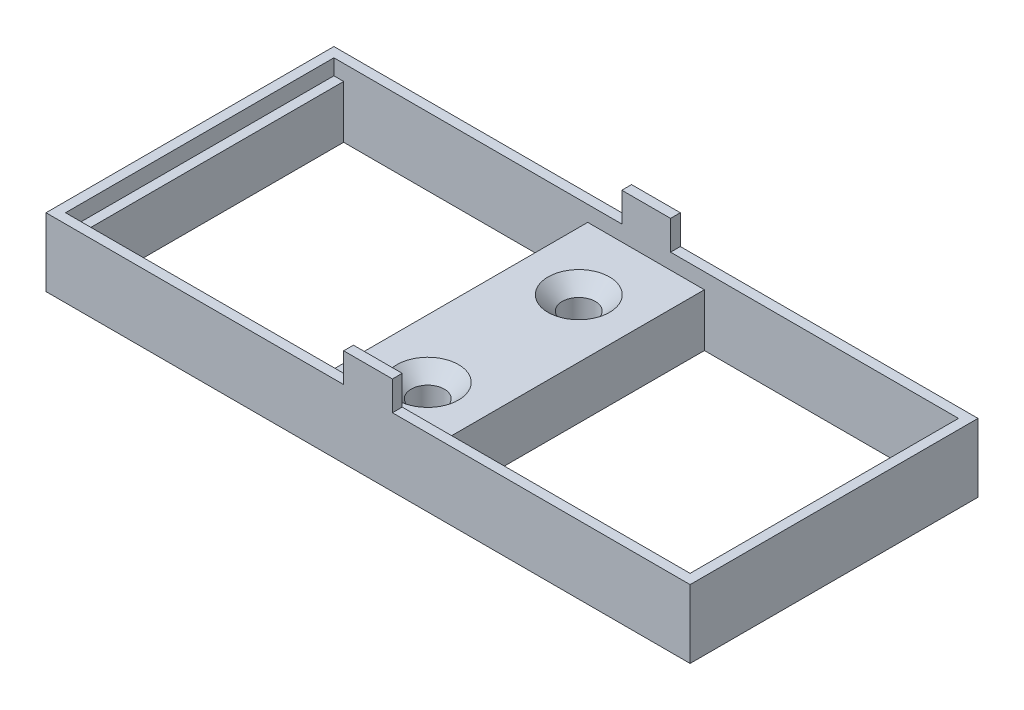
ISO-10303-21;
HEADER;
FILE_DESCRIPTION(('STEP AP214'),'2;1');
FILE_NAME('part.step','',(''),(''),'','','');
FILE_SCHEMA(('AUTOMOTIVE_DESIGN { 1 0 10303 214 1 1 1 1 }'));
ENDSEC;
DATA;
#1=APPLICATION_CONTEXT('core data for automotive mechanical design processes');
#2=APPLICATION_PROTOCOL_DEFINITION('international standard','automotive_design',2000,#1);
#3=PRODUCT_CONTEXT('',#1,'mechanical');
#4=PRODUCT('Part','Part','',(#3));
#5=PRODUCT_RELATED_PRODUCT_CATEGORY('part','',(#4));
#6=PRODUCT_DEFINITION_FORMATION('','',#4);
#7=PRODUCT_DEFINITION_CONTEXT('part definition',#1,'design');
#8=PRODUCT_DEFINITION('design','',#6,#7);
#9=PRODUCT_DEFINITION_SHAPE('','',#8);
#10=(LENGTH_UNIT() NAMED_UNIT(*) SI_UNIT(.MILLI.,.METRE.));
#11=(NAMED_UNIT(*) PLANE_ANGLE_UNIT() SI_UNIT($,.RADIAN.));
#12=(NAMED_UNIT(*) SI_UNIT($,.STERADIAN.) SOLID_ANGLE_UNIT());
#13=UNCERTAINTY_MEASURE_WITH_UNIT(LENGTH_MEASURE(1.E-05),#10,'distance_accuracy_value','');
#14=(GEOMETRIC_REPRESENTATION_CONTEXT(3) GLOBAL_UNCERTAINTY_ASSIGNED_CONTEXT((#13)) GLOBAL_UNIT_ASSIGNED_CONTEXT((#10,
#11,#12)) REPRESENTATION_CONTEXT('',''));
#15=CARTESIAN_POINT('',(0.,0.,0.));
#16=DIRECTION('',(0.,0.,1.));
#17=DIRECTION('',(1.,0.,0.));
#18=AXIS2_PLACEMENT_3D('',#15,#16,#17);
#19=CARTESIAN_POINT('',(0.,5.4,0.));
#20=DIRECTION('',(0.,1.,0.));
#21=DIRECTION('',(0.,0.,1.));
#22=AXIS2_PLACEMENT_3D('',#19,#20,#21);
#23=PLANE('',#22);
#24=DIRECTION('',(0.,0.,1.));
#25=VECTOR('',#24,1.);
#26=CARTESIAN_POINT('',(2.,5.4,1.));
#27=LINE('',#26,#25);
#28=CARTESIAN_POINT('',(2.,5.4,1.));
#29=VERTEX_POINT('',#28);
#30=CARTESIAN_POINT('',(2.,5.4,28.5));
#31=VERTEX_POINT('',#30);
#32=EDGE_CURVE('E211',#29,#31,#27,.T.);
#33=ORIENTED_EDGE('',*,*,#32,.F.);
#34=DIRECTION('',(-1.,0.,0.));
#35=VECTOR('',#34,1.);
#36=CARTESIAN_POINT('',(1.,5.4,1.));
#37=LINE('',#36,#35);
#38=CARTESIAN_POINT('',(1.,5.4,1.));
#39=VERTEX_POINT('',#38);
#40=EDGE_CURVE('E226',#29,#39,#37,.T.);
#41=ORIENTED_EDGE('',*,*,#40,.T.);
#42=DIRECTION('',(0.,0.,1.));
#43=VECTOR('',#42,1.);
#44=CARTESIAN_POINT('',(1.,5.4,1.));
#45=LINE('',#44,#43);
#46=CARTESIAN_POINT('',(1.,5.4,28.5));
#47=VERTEX_POINT('',#46);
#48=EDGE_CURVE('E220',#39,#47,#45,.T.);
#49=ORIENTED_EDGE('',*,*,#48,.T.);
#50=DIRECTION('',(1.,0.,0.));
#51=VECTOR('',#50,1.);
#52=CARTESIAN_POINT('',(1.,5.4,28.5));
#53=LINE('',#52,#51);
#54=EDGE_CURVE('E202',#47,#31,#53,.T.);
#55=ORIENTED_EDGE('',*,*,#54,.T.);
#56=EDGE_LOOP('',(#33,#41,#49,#55));
#57=FACE_BOUND('',#56,.T.);
#58=ADVANCED_FACE('F35',(#57),#23,.T.);
#59=CARTESIAN_POINT('',(32.9664490428989,5.4,7.875));
#60=DIRECTION('',(0.,1.,0.));
#61=DIRECTION('',(0.,0.,1.));
#62=AXIS2_PLACEMENT_3D('',#59,#60,#61);
#63=CIRCLE('',#62,3.15);
#64=CARTESIAN_POINT('',(32.9664490428989,5.4,11.025));
#65=VERTEX_POINT('',#64);
#66=EDGE_CURVE('E269',#65,#65,#63,.T.);
#67=ORIENTED_EDGE('',*,*,#66,.F.);
#68=EDGE_LOOP('',(#67));
#69=FACE_BOUND('',#68,.T.);
#70=CARTESIAN_POINT('',(33.0089004378733,5.4,23.3906336009247));
#71=DIRECTION('',(0.,1.,0.));
#72=DIRECTION('',(0.,0.,1.));
#73=AXIS2_PLACEMENT_3D('',#70,#71,#72);
#74=CIRCLE('',#73,3.15);
#75=CARTESIAN_POINT('',(33.0089004378733,5.4,26.5406336009247));
#76=VERTEX_POINT('',#75);
#77=EDGE_CURVE('E260',#76,#76,#74,.T.);
#78=ORIENTED_EDGE('',*,*,#77,.F.);
#79=EDGE_LOOP('',(#78));
#80=FACE_BOUND('',#79,.T.);
#81=DIRECTION('',(0.,0.,-1.));
#82=VECTOR('',#81,1.);
#83=CARTESIAN_POINT('',(27.0089004378733,5.4,1.));
#84=LINE('',#83,#82);
#85=CARTESIAN_POINT('',(27.0089004378733,5.4,28.5));
#86=VERTEX_POINT('',#85);
#87=CARTESIAN_POINT('',(27.0089004378733,5.4,1.));
#88=VERTEX_POINT('',#87);
#89=EDGE_CURVE('E208',#86,#88,#84,.T.);
#90=ORIENTED_EDGE('',*,*,#89,.F.);
#91=CARTESIAN_POINT('',(38.9664490428989,5.4,28.5));
#92=VERTEX_POINT('',#91);
#93=EDGE_CURVE('E222',#86,#92,#53,.T.);
#94=ORIENTED_EDGE('',*,*,#93,.T.);
#95=DIRECTION('',(0.,0.,1.));
#96=VECTOR('',#95,1.);
#97=CARTESIAN_POINT('',(38.9664490428989,5.4,1.));
#98=LINE('',#97,#96);
#99=CARTESIAN_POINT('',(38.9664490428989,5.4,1.));
#100=VERTEX_POINT('',#99);
#101=EDGE_CURVE('E245',#100,#92,#98,.T.);
#102=ORIENTED_EDGE('',*,*,#101,.F.);
#103=EDGE_CURVE('E287',#100,#88,#37,.T.);
#104=ORIENTED_EDGE('',*,*,#103,.T.);
#105=EDGE_LOOP('',(#90,#94,#102,#104));
#106=FACE_BOUND('',#105,.T.);
#107=ADVANCED_FACE('F275',(#69,#80,#106),#23,.T.);
#108=CARTESIAN_POINT('',(0.,7.,0.));
#109=DIRECTION('',(0.,-1.,0.));
#110=DIRECTION('',(0.,0.,-1.));
#111=AXIS2_PLACEMENT_3D('',#108,#109,#110);
#112=PLANE('',#111);
#113=DIRECTION('',(0.,0.,-1.));
#114=VECTOR('',#113,1.);
#115=CARTESIAN_POINT('',(35.5,7.,0.));
#116=LINE('',#115,#114);
#117=CARTESIAN_POINT('',(35.5,7.,1.));
#118=VERTEX_POINT('',#117);
#119=CARTESIAN_POINT('',(35.5,7.,0.));
#120=VERTEX_POINT('',#119);
#121=EDGE_CURVE('E353',#118,#120,#116,.T.);
#122=ORIENTED_EDGE('',*,*,#121,.F.);
#123=DIRECTION('',(-1.,0.,0.));
#124=VECTOR('',#123,1.);
#125=CARTESIAN_POINT('',(1.,7.,1.));
#126=LINE('',#125,#124);
#127=CARTESIAN_POINT('',(65.,7.,1.));
#128=VERTEX_POINT('',#127);
#129=EDGE_CURVE('E233',#128,#118,#126,.T.);
#130=ORIENTED_EDGE('',*,*,#129,.F.);
#131=DIRECTION('',(0.,0.,-1.));
#132=VECTOR('',#131,1.);
#133=CARTESIAN_POINT('',(65.,7.,1.));
#134=LINE('',#133,#132);
#135=CARTESIAN_POINT('',(65.,7.,28.5));
#136=VERTEX_POINT('',#135);
#137=EDGE_CURVE('E310',#136,#128,#134,.T.);
#138=ORIENTED_EDGE('',*,*,#137,.F.);
#139=DIRECTION('',(1.,0.,0.));
#140=VECTOR('',#139,1.);
#141=CARTESIAN_POINT('',(1.,7.,28.5));
#142=LINE('',#141,#140);
#143=CARTESIAN_POINT('',(35.5,7.,28.5));
#144=VERTEX_POINT('',#143);
#145=EDGE_CURVE('E307',#144,#136,#142,.T.);
#146=ORIENTED_EDGE('',*,*,#145,.F.);
#147=DIRECTION('',(0.,0.,-1.));
#148=VECTOR('',#147,1.);
#149=CARTESIAN_POINT('',(35.5,7.,28.5));
#150=LINE('',#149,#148);
#151=CARTESIAN_POINT('',(35.5,7.,29.5));
#152=VERTEX_POINT('',#151);
#153=EDGE_CURVE('E316',#152,#144,#150,.T.);
#154=ORIENTED_EDGE('',*,*,#153,.F.);
#155=DIRECTION('',(1.,0.,0.));
#156=VECTOR('',#155,1.);
#157=CARTESIAN_POINT('',(0.,7.,29.5));
#158=LINE('',#157,#156);
#159=CARTESIAN_POINT('',(66.,7.,29.5));
#160=VERTEX_POINT('',#159);
#161=EDGE_CURVE('E378',#152,#160,#158,.T.);
#162=ORIENTED_EDGE('',*,*,#161,.T.);
#163=DIRECTION('',(0.,0.,1.));
#164=VECTOR('',#163,1.);
#165=CARTESIAN_POINT('',(66.,7.,0.));
#166=LINE('',#165,#164);
#167=CARTESIAN_POINT('',(66.,7.,0.));
#168=VERTEX_POINT('',#167);
#169=EDGE_CURVE('E377',#168,#160,#166,.T.);
#170=ORIENTED_EDGE('',*,*,#169,.F.);
#171=DIRECTION('',(1.,0.,0.));
#172=VECTOR('',#171,1.);
#173=CARTESIAN_POINT('',(0.,7.,0.));
#174=LINE('',#173,#172);
#175=EDGE_CURVE('E381',#120,#168,#174,.T.);
#176=ORIENTED_EDGE('',*,*,#175,.F.);
#177=EDGE_LOOP('',(#122,#130,#138,#146,#154,#162,#170,#176));
#178=FACE_BOUND('',#177,.T.);
#179=ADVANCED_FACE('F278',(#178),#112,.F.);
#180=DIRECTION('',(0.,0.,1.));
#181=VECTOR('',#180,1.);
#182=CARTESIAN_POINT('',(1.,7.,1.));
#183=LINE('',#182,#181);
#184=CARTESIAN_POINT('',(1.,7.,1.));
#185=VERTEX_POINT('',#184);
#186=CARTESIAN_POINT('',(1.,7.,28.5));
#187=VERTEX_POINT('',#186);
#188=EDGE_CURVE('E253',#185,#187,#183,.T.);
#189=ORIENTED_EDGE('',*,*,#188,.F.);
#190=CARTESIAN_POINT('',(30.5,7.,1.));
#191=VERTEX_POINT('',#190);
#192=EDGE_CURVE('E234',#191,#185,#126,.T.);
#193=ORIENTED_EDGE('',*,*,#192,.F.);
#194=DIRECTION('',(0.,0.,1.));
#195=VECTOR('',#194,1.);
#196=CARTESIAN_POINT('',(30.5,7.,0.));
#197=LINE('',#196,#195);
#198=CARTESIAN_POINT('',(30.5,7.,0.));
#199=VERTEX_POINT('',#198);
#200=EDGE_CURVE('E348',#199,#191,#197,.T.);
#201=ORIENTED_EDGE('',*,*,#200,.F.);
#202=CARTESIAN_POINT('',(0.,7.,0.));
#203=VERTEX_POINT('',#202);
#204=EDGE_CURVE('E382',#203,#199,#174,.T.);
#205=ORIENTED_EDGE('',*,*,#204,.F.);
#206=DIRECTION('',(0.,0.,1.));
#207=VECTOR('',#206,1.);
#208=CARTESIAN_POINT('',(0.,7.,0.));
#209=LINE('',#208,#207);
#210=CARTESIAN_POINT('',(0.,7.,29.5));
#211=VERTEX_POINT('',#210);
#212=EDGE_CURVE('E385',#203,#211,#209,.T.);
#213=ORIENTED_EDGE('',*,*,#212,.T.);
#214=CARTESIAN_POINT('',(30.5,7.,29.5));
#215=VERTEX_POINT('',#214);
#216=EDGE_CURVE('E375',#211,#215,#158,.T.);
#217=ORIENTED_EDGE('',*,*,#216,.T.);
#218=DIRECTION('',(0.,0.,1.));
#219=VECTOR('',#218,1.);
#220=CARTESIAN_POINT('',(30.5,7.,28.5));
#221=LINE('',#220,#219);
#222=CARTESIAN_POINT('',(30.5,7.,28.5));
#223=VERTEX_POINT('',#222);
#224=EDGE_CURVE('E327',#223,#215,#221,.T.);
#225=ORIENTED_EDGE('',*,*,#224,.F.);
#226=EDGE_CURVE('E308',#187,#223,#142,.T.);
#227=ORIENTED_EDGE('',*,*,#226,.F.);
#228=EDGE_LOOP('',(#189,#193,#201,#205,#213,#217,#225,#227));
#229=FACE_BOUND('',#228,.T.);
#230=ADVANCED_FACE('F465',(#229),#112,.F.);
#231=CARTESIAN_POINT('',(0.,7.,29.5));
#232=DIRECTION('',(0.,0.,-1.));
#233=DIRECTION('',(-1.,0.,0.));
#234=AXIS2_PLACEMENT_3D('',#231,#232,#233);
#235=PLANE('',#234);
#236=DIRECTION('',(1.,0.,0.));
#237=VECTOR('',#236,1.);
#238=CARTESIAN_POINT('',(0.,0.,29.5));
#239=LINE('',#238,#237);
#240=CARTESIAN_POINT('',(0.,0.,29.5));
#241=VERTEX_POINT('',#240);
#242=CARTESIAN_POINT('',(66.,0.,29.5));
#243=VERTEX_POINT('',#242);
#244=EDGE_CURVE('E374',#241,#243,#239,.T.);
#245=ORIENTED_EDGE('',*,*,#244,.T.);
#246=DIRECTION('',(0.,-1.,0.));
#247=VECTOR('',#246,1.);
#248=CARTESIAN_POINT('',(66.,7.,29.5));
#249=LINE('',#248,#247);
#250=EDGE_CURVE('E404',#160,#243,#249,.T.);
#251=ORIENTED_EDGE('',*,*,#250,.F.);
#252=ORIENTED_EDGE('',*,*,#161,.F.);
#253=DIRECTION('',(0.,-1.,0.));
#254=VECTOR('',#253,1.);
#255=CARTESIAN_POINT('',(35.5,10.,29.5));
#256=LINE('',#255,#254);
#257=CARTESIAN_POINT('',(35.5,10.,29.5));
#258=VERTEX_POINT('',#257);
#259=EDGE_CURVE('E333',#258,#152,#256,.T.);
#260=ORIENTED_EDGE('',*,*,#259,.F.);
#261=DIRECTION('',(1.,0.,0.));
#262=VECTOR('',#261,1.);
#263=CARTESIAN_POINT('',(35.5,10.,29.5));
#264=LINE('',#263,#262);
#265=CARTESIAN_POINT('',(30.5,10.,29.5));
#266=VERTEX_POINT('',#265);
#267=EDGE_CURVE('E331',#266,#258,#264,.T.);
#268=ORIENTED_EDGE('',*,*,#267,.F.);
#269=DIRECTION('',(0.,-1.,0.));
#270=VECTOR('',#269,1.);
#271=CARTESIAN_POINT('',(30.5,10.,29.5));
#272=LINE('',#271,#270);
#273=EDGE_CURVE('E340',#266,#215,#272,.T.);
#274=ORIENTED_EDGE('',*,*,#273,.T.);
#275=ORIENTED_EDGE('',*,*,#216,.F.);
#276=DIRECTION('',(0.,-1.,0.));
#277=VECTOR('',#276,1.);
#278=CARTESIAN_POINT('',(0.,7.,29.5));
#279=LINE('',#278,#277);
#280=EDGE_CURVE('E387',#211,#241,#279,.T.);
#281=ORIENTED_EDGE('',*,*,#280,.T.);
#282=EDGE_LOOP('',(#245,#251,#252,#260,#268,#274,#275,#281));
#283=FACE_BOUND('',#282,.T.);
#284=ADVANCED_FACE('F37',(#283),#235,.F.);
#285=CARTESIAN_POINT('',(66.,7.,0.));
#286=DIRECTION('',(1.,0.,0.));
#287=DIRECTION('',(0.,0.,-1.));
#288=AXIS2_PLACEMENT_3D('',#285,#286,#287);
#289=PLANE('',#288);
#290=DIRECTION('',(0.,0.,1.));
#291=VECTOR('',#290,1.);
#292=CARTESIAN_POINT('',(66.,0.,0.));
#293=LINE('',#292,#291);
#294=CARTESIAN_POINT('',(66.,0.,0.));
#295=VERTEX_POINT('',#294);
#296=EDGE_CURVE('E390',#295,#243,#293,.T.);
#297=ORIENTED_EDGE('',*,*,#296,.F.);
#298=DIRECTION('',(0.,-1.,0.));
#299=VECTOR('',#298,1.);
#300=CARTESIAN_POINT('',(66.,7.,0.));
#301=LINE('',#300,#299);
#302=EDGE_CURVE('E402',#168,#295,#301,.T.);
#303=ORIENTED_EDGE('',*,*,#302,.F.);
#304=ORIENTED_EDGE('',*,*,#169,.T.);
#305=ORIENTED_EDGE('',*,*,#250,.T.);
#306=EDGE_LOOP('',(#297,#303,#304,#305));
#307=FACE_BOUND('',#306,.T.);
#308=ADVANCED_FACE('F444',(#307),#289,.T.);
#309=CARTESIAN_POINT('',(0.,7.,0.));
#310=DIRECTION('',(0.,0.,-1.));
#311=DIRECTION('',(-1.,0.,0.));
#312=AXIS2_PLACEMENT_3D('',#309,#310,#311);
#313=PLANE('',#312);
#314=DIRECTION('',(1.,0.,0.));
#315=VECTOR('',#314,1.);
#316=CARTESIAN_POINT('',(0.,0.,0.));
#317=LINE('',#316,#315);
#318=CARTESIAN_POINT('',(0.,0.,0.));
#319=VERTEX_POINT('',#318);
#320=EDGE_CURVE('E393',#319,#295,#317,.T.);
#321=ORIENTED_EDGE('',*,*,#320,.F.);
#322=DIRECTION('',(0.,-1.,0.));
#323=VECTOR('',#322,1.);
#324=CARTESIAN_POINT('',(0.,7.,0.));
#325=LINE('',#324,#323);
#326=EDGE_CURVE('E400',#203,#319,#325,.T.);
#327=ORIENTED_EDGE('',*,*,#326,.F.);
#328=ORIENTED_EDGE('',*,*,#204,.T.);
#329=DIRECTION('',(0.,-1.,0.));
#330=VECTOR('',#329,1.);
#331=CARTESIAN_POINT('',(30.5,10.,0.));
#332=LINE('',#331,#330);
#333=CARTESIAN_POINT('',(30.5,10.,0.));
#334=VERTEX_POINT('',#333);
#335=EDGE_CURVE('E359',#334,#199,#332,.T.);
#336=ORIENTED_EDGE('',*,*,#335,.F.);
#337=DIRECTION('',(-1.,0.,0.));
#338=VECTOR('',#337,1.);
#339=CARTESIAN_POINT('',(30.5,10.,0.));
#340=LINE('',#339,#338);
#341=CARTESIAN_POINT('',(35.5,10.,0.));
#342=VERTEX_POINT('',#341);
#343=EDGE_CURVE('E357',#342,#334,#340,.T.);
#344=ORIENTED_EDGE('',*,*,#343,.F.);
#345=DIRECTION('',(0.,-1.,0.));
#346=VECTOR('',#345,1.);
#347=CARTESIAN_POINT('',(35.5,10.,0.));
#348=LINE('',#347,#346);
#349=EDGE_CURVE('E366',#342,#120,#348,.T.);
#350=ORIENTED_EDGE('',*,*,#349,.T.);
#351=ORIENTED_EDGE('',*,*,#175,.T.);
#352=ORIENTED_EDGE('',*,*,#302,.T.);
#353=EDGE_LOOP('',(#321,#327,#328,#336,#344,#350,#351,#352));
#354=FACE_BOUND('',#353,.T.);
#355=ADVANCED_FACE('F439',(#354),#313,.T.);
#356=CARTESIAN_POINT('',(0.,7.,0.));
#357=DIRECTION('',(1.,0.,0.));
#358=DIRECTION('',(0.,0.,-1.));
#359=AXIS2_PLACEMENT_3D('',#356,#357,#358);
#360=PLANE('',#359);
#361=DIRECTION('',(0.,0.,1.));
#362=VECTOR('',#361,1.);
#363=CARTESIAN_POINT('',(0.,0.,0.));
#364=LINE('',#363,#362);
#365=EDGE_CURVE('E396',#319,#241,#364,.T.);
#366=ORIENTED_EDGE('',*,*,#365,.T.);
#367=ORIENTED_EDGE('',*,*,#280,.F.);
#368=ORIENTED_EDGE('',*,*,#212,.F.);
#369=ORIENTED_EDGE('',*,*,#326,.T.);
#370=EDGE_LOOP('',(#366,#367,#368,#369));
#371=FACE_BOUND('',#370,.T.);
#372=ADVANCED_FACE('F423',(#371),#360,.F.);
#373=CARTESIAN_POINT('',(0.,0.,0.));
#374=DIRECTION('',(0.,-1.,0.));
#375=DIRECTION('',(0.,0.,-1.));
#376=AXIS2_PLACEMENT_3D('',#373,#374,#375);
#377=PLANE('',#376);
#378=CARTESIAN_POINT('',(32.9664490428989,0.,7.875));
#379=DIRECTION('',(0.,1.,0.));
#380=DIRECTION('',(0.,0.,1.));
#381=AXIS2_PLACEMENT_3D('',#378,#379,#380);
#382=CIRCLE('',#381,1.7);
#383=CARTESIAN_POINT('',(32.9664490428989,0.,9.575));
#384=VERTEX_POINT('',#383);
#385=EDGE_CURVE('E263',#384,#384,#382,.T.);
#386=ORIENTED_EDGE('',*,*,#385,.T.);
#387=EDGE_LOOP('',(#386));
#388=FACE_BOUND('',#387,.T.);
#389=CARTESIAN_POINT('',(33.0089004378733,0.,23.3906336009247));
#390=DIRECTION('',(0.,1.,0.));
#391=DIRECTION('',(0.,0.,1.));
#392=AXIS2_PLACEMENT_3D('',#389,#390,#391);
#393=CIRCLE('',#392,1.7);
#394=CARTESIAN_POINT('',(33.0089004378733,0.,25.0906336009247));
#395=VERTEX_POINT('',#394);
#396=EDGE_CURVE('E247',#395,#395,#393,.T.);
#397=ORIENTED_EDGE('',*,*,#396,.T.);
#398=EDGE_LOOP('',(#397));
#399=FACE_BOUND('',#398,.T.);
#400=DIRECTION('',(0.,0.,-1.));
#401=VECTOR('',#400,1.);
#402=CARTESIAN_POINT('',(2.,0.,0.));
#403=LINE('',#402,#401);
#404=CARTESIAN_POINT('',(2.,0.,28.5));
#405=VERTEX_POINT('',#404);
#406=CARTESIAN_POINT('',(2.,0.,1.));
#407=VERTEX_POINT('',#406);
#408=EDGE_CURVE('E11',#405,#407,#403,.T.);
#409=ORIENTED_EDGE('',*,*,#408,.F.);
#410=DIRECTION('',(-1.,0.,0.));
#411=VECTOR('',#410,1.);
#412=CARTESIAN_POINT('',(0.,0.,28.5));
#413=LINE('',#412,#411);
#414=CARTESIAN_POINT('',(27.0089004378733,0.,28.5));
#415=VERTEX_POINT('',#414);
#416=EDGE_CURVE('E205',#415,#405,#413,.T.);
#417=ORIENTED_EDGE('',*,*,#416,.F.);
#418=DIRECTION('',(0.,0.,1.));
#419=VECTOR('',#418,1.);
#420=CARTESIAN_POINT('',(27.0089004378733,0.,0.));
#421=LINE('',#420,#419);
#422=CARTESIAN_POINT('',(27.0089004378733,0.,1.));
#423=VERTEX_POINT('',#422);
#424=EDGE_CURVE('E414',#423,#415,#421,.T.);
#425=ORIENTED_EDGE('',*,*,#424,.F.);
#426=DIRECTION('',(1.,0.,0.));
#427=VECTOR('',#426,1.);
#428=CARTESIAN_POINT('',(0.,0.,1.));
#429=LINE('',#428,#427);
#430=EDGE_CURVE('E43',#407,#423,#429,.T.);
#431=ORIENTED_EDGE('',*,*,#430,.F.);
#432=EDGE_LOOP('',(#409,#417,#425,#431));
#433=FACE_BOUND('',#432,.T.);
#434=DIRECTION('',(0.,0.,-1.));
#435=VECTOR('',#434,1.);
#436=CARTESIAN_POINT('',(38.9664490428989,0.,0.));
#437=LINE('',#436,#435);
#438=CARTESIAN_POINT('',(38.9664490428989,0.,28.5));
#439=VERTEX_POINT('',#438);
#440=CARTESIAN_POINT('',(38.9664490428989,0.,1.));
#441=VERTEX_POINT('',#440);
#442=EDGE_CURVE('E411',#439,#441,#437,.T.);
#443=ORIENTED_EDGE('',*,*,#442,.F.);
#444=DIRECTION('',(-1.,0.,0.));
#445=VECTOR('',#444,1.);
#446=CARTESIAN_POINT('',(0.,0.,28.5));
#447=LINE('',#446,#445);
#448=CARTESIAN_POINT('',(64.,0.,28.5));
#449=VERTEX_POINT('',#448);
#450=EDGE_CURVE('E291',#449,#439,#447,.T.);
#451=ORIENTED_EDGE('',*,*,#450,.F.);
#452=DIRECTION('',(0.,0.,1.));
#453=VECTOR('',#452,1.);
#454=CARTESIAN_POINT('',(64.,0.,0.));
#455=LINE('',#454,#453);
#456=CARTESIAN_POINT('',(64.,0.,1.));
#457=VERTEX_POINT('',#456);
#458=EDGE_CURVE('E407',#457,#449,#455,.T.);
#459=ORIENTED_EDGE('',*,*,#458,.F.);
#460=DIRECTION('',(1.,0.,0.));
#461=VECTOR('',#460,1.);
#462=CARTESIAN_POINT('',(0.,0.,1.));
#463=LINE('',#462,#461);
#464=EDGE_CURVE('E409',#441,#457,#463,.T.);
#465=ORIENTED_EDGE('',*,*,#464,.F.);
#466=EDGE_LOOP('',(#443,#451,#459,#465));
#467=FACE_BOUND('',#466,.T.);
#468=ORIENTED_EDGE('',*,*,#244,.F.);
#469=ORIENTED_EDGE('',*,*,#365,.F.);
#470=ORIENTED_EDGE('',*,*,#320,.T.);
#471=ORIENTED_EDGE('',*,*,#296,.T.);
#472=EDGE_LOOP('',(#468,#469,#470,#471));
#473=FACE_BOUND('',#472,.T.);
#474=ADVANCED_FACE('F419',(#388,#399,#433,#467,#473),#377,.T.);
#475=CARTESIAN_POINT('',(30.5,10.,0.));
#476=DIRECTION('',(1.,0.,0.));
#477=DIRECTION('',(0.,0.,-1.));
#478=AXIS2_PLACEMENT_3D('',#475,#476,#477);
#479=PLANE('',#478);
#480=ORIENTED_EDGE('',*,*,#200,.T.);
#481=DIRECTION('',(0.,-1.,0.));
#482=VECTOR('',#481,1.);
#483=CARTESIAN_POINT('',(30.5,10.,1.));
#484=LINE('',#483,#482);
#485=CARTESIAN_POINT('',(30.5,10.,1.));
#486=VERTEX_POINT('',#485);
#487=EDGE_CURVE('E372',#486,#191,#484,.T.);
#488=ORIENTED_EDGE('',*,*,#487,.F.);
#489=DIRECTION('',(0.,0.,1.));
#490=VECTOR('',#489,1.);
#491=CARTESIAN_POINT('',(30.5,10.,0.));
#492=LINE('',#491,#490);
#493=EDGE_CURVE('E349',#334,#486,#492,.T.);
#494=ORIENTED_EDGE('',*,*,#493,.F.);
#495=ORIENTED_EDGE('',*,*,#335,.T.);
#496=EDGE_LOOP('',(#480,#488,#494,#495));
#497=FACE_BOUND('',#496,.T.);
#498=ADVANCED_FACE('F422',(#497),#479,.F.);
#499=CARTESIAN_POINT('',(30.5,10.,1.));
#500=DIRECTION('',(0.,0.,-1.));
#501=DIRECTION('',(-1.,0.,0.));
#502=AXIS2_PLACEMENT_3D('',#499,#500,#501);
#503=PLANE('',#502);
#504=ORIENTED_EDGE('',*,*,#487,.T.);
#505=ORIENTED_EDGE('',*,*,#192,.T.);
#506=DIRECTION('',(0.,1.,0.));
#507=VECTOR('',#506,1.);
#508=CARTESIAN_POINT('',(1.,5.4,1.));
#509=LINE('',#508,#507);
#510=EDGE_CURVE('E313',#39,#185,#509,.T.);
#511=ORIENTED_EDGE('',*,*,#510,.F.);
#512=ORIENTED_EDGE('',*,*,#40,.F.);
#513=DIRECTION('',(0.,1.,0.));
#514=VECTOR('',#513,1.);
#515=CARTESIAN_POINT('',(2.,-4.6,1.));
#516=LINE('',#515,#514);
#517=EDGE_CURVE('E214',#407,#29,#516,.T.);
#518=ORIENTED_EDGE('',*,*,#517,.F.);
#519=ORIENTED_EDGE('',*,*,#430,.T.);
#520=DIRECTION('',(0.,1.,0.));
#521=VECTOR('',#520,1.);
#522=CARTESIAN_POINT('',(27.0089004378733,-4.6,1.));
#523=LINE('',#522,#521);
#524=EDGE_CURVE('E250',#423,#88,#523,.T.);
#525=ORIENTED_EDGE('',*,*,#524,.T.);
#526=ORIENTED_EDGE('',*,*,#103,.F.);
#527=DIRECTION('',(0.,1.,0.));
#528=VECTOR('',#527,1.);
#529=CARTESIAN_POINT('',(38.9664490428989,-4.6,1.));
#530=LINE('',#529,#528);
#531=EDGE_CURVE('E217',#441,#100,#530,.T.);
#532=ORIENTED_EDGE('',*,*,#531,.F.);
#533=ORIENTED_EDGE('',*,*,#464,.T.);
#534=DIRECTION('',(0.,1.,0.));
#535=VECTOR('',#534,1.);
#536=CARTESIAN_POINT('',(64.,-4.6,1.));
#537=LINE('',#536,#535);
#538=CARTESIAN_POINT('',(64.,5.4,1.));
#539=VERTEX_POINT('',#538);
#540=EDGE_CURVE('E241',#457,#539,#537,.T.);
#541=ORIENTED_EDGE('',*,*,#540,.T.);
#542=CARTESIAN_POINT('',(65.,5.4,1.));
#543=VERTEX_POINT('',#542);
#544=EDGE_CURVE('E300',#543,#539,#37,.T.);
#545=ORIENTED_EDGE('',*,*,#544,.F.);
#546=DIRECTION('',(0.,1.,0.));
#547=VECTOR('',#546,1.);
#548=CARTESIAN_POINT('',(65.,5.4,1.));
#549=LINE('',#548,#547);
#550=EDGE_CURVE('E317',#543,#128,#549,.T.);
#551=ORIENTED_EDGE('',*,*,#550,.T.);
#552=ORIENTED_EDGE('',*,*,#129,.T.);
#553=DIRECTION('',(0.,-1.,0.));
#554=VECTOR('',#553,1.);
#555=CARTESIAN_POINT('',(35.5,10.,1.));
#556=LINE('',#555,#554);
#557=CARTESIAN_POINT('',(35.5,10.,1.));
#558=VERTEX_POINT('',#557);
#559=EDGE_CURVE('E369',#558,#118,#556,.T.);
#560=ORIENTED_EDGE('',*,*,#559,.F.);
#561=DIRECTION('',(1.,0.,0.));
#562=VECTOR('',#561,1.);
#563=CARTESIAN_POINT('',(30.5,10.,1.));
#564=LINE('',#563,#562);
#565=EDGE_CURVE('E352',#486,#558,#564,.T.);
#566=ORIENTED_EDGE('',*,*,#565,.F.);
#567=EDGE_LOOP('',(#504,#505,#511,#512,#518,#519,#525,#526,#532,#533,#541,#545,#551,#552,#560,#566));
#568=FACE_BOUND('',#567,.T.);
#569=ADVANCED_FACE('F298',(#568),#503,.F.);
#570=CARTESIAN_POINT('',(35.5,10.,0.));
#571=DIRECTION('',(-1.,0.,0.));
#572=DIRECTION('',(0.,0.,1.));
#573=AXIS2_PLACEMENT_3D('',#570,#571,#572);
#574=PLANE('',#573);
#575=ORIENTED_EDGE('',*,*,#121,.T.);
#576=ORIENTED_EDGE('',*,*,#349,.F.);
#577=DIRECTION('',(0.,0.,-1.));
#578=VECTOR('',#577,1.);
#579=CARTESIAN_POINT('',(35.5,10.,0.));
#580=LINE('',#579,#578);
#581=EDGE_CURVE('E355',#558,#342,#580,.T.);
#582=ORIENTED_EDGE('',*,*,#581,.F.);
#583=ORIENTED_EDGE('',*,*,#559,.T.);
#584=EDGE_LOOP('',(#575,#576,#582,#583));
#585=FACE_BOUND('',#584,.T.);
#586=ADVANCED_FACE('F476',(#585),#574,.F.);
#587=CARTESIAN_POINT('',(0.,10.,0.));
#588=DIRECTION('',(0.,1.,0.));
#589=DIRECTION('',(0.,0.,1.));
#590=AXIS2_PLACEMENT_3D('',#587,#588,#589);
#591=PLANE('',#590);
#592=ORIENTED_EDGE('',*,*,#493,.T.);
#593=ORIENTED_EDGE('',*,*,#565,.T.);
#594=ORIENTED_EDGE('',*,*,#581,.T.);
#595=ORIENTED_EDGE('',*,*,#343,.T.);
#596=EDGE_LOOP('',(#592,#593,#594,#595));
#597=FACE_BOUND('',#596,.T.);
#598=ADVANCED_FACE('F472',(#597),#591,.T.);
#599=CARTESIAN_POINT('',(35.5,10.,28.5));
#600=DIRECTION('',(-1.,0.,0.));
#601=DIRECTION('',(0.,0.,1.));
#602=AXIS2_PLACEMENT_3D('',#599,#600,#601);
#603=PLANE('',#602);
#604=ORIENTED_EDGE('',*,*,#153,.T.);
#605=DIRECTION('',(0.,-1.,0.));
#606=VECTOR('',#605,1.);
#607=CARTESIAN_POINT('',(35.5,10.,28.5));
#608=LINE('',#607,#606);
#609=CARTESIAN_POINT('',(35.5,10.,28.5));
#610=VERTEX_POINT('',#609);
#611=EDGE_CURVE('E346',#610,#144,#608,.T.);
#612=ORIENTED_EDGE('',*,*,#611,.F.);
#613=DIRECTION('',(0.,0.,-1.));
#614=VECTOR('',#613,1.);
#615=CARTESIAN_POINT('',(35.5,10.,28.5));
#616=LINE('',#615,#614);
#617=EDGE_CURVE('E323',#258,#610,#616,.T.);
#618=ORIENTED_EDGE('',*,*,#617,.F.);
#619=ORIENTED_EDGE('',*,*,#259,.T.);
#620=EDGE_LOOP('',(#604,#612,#618,#619));
#621=FACE_BOUND('',#620,.T.);
#622=ADVANCED_FACE('F453',(#621),#603,.F.);
#623=CARTESIAN_POINT('',(35.5,10.,28.5));
#624=DIRECTION('',(0.,0.,1.));
#625=DIRECTION('',(1.,0.,0.));
#626=AXIS2_PLACEMENT_3D('',#623,#624,#625);
#627=PLANE('',#626);
#628=ORIENTED_EDGE('',*,*,#611,.T.);
#629=ORIENTED_EDGE('',*,*,#145,.T.);
#630=DIRECTION('',(0.,1.,0.));
#631=VECTOR('',#630,1.);
#632=CARTESIAN_POINT('',(65.,5.4,28.5));
#633=LINE('',#632,#631);
#634=CARTESIAN_POINT('',(65.,5.4,28.5));
#635=VERTEX_POINT('',#634);
#636=EDGE_CURVE('E319',#635,#136,#633,.T.);
#637=ORIENTED_EDGE('',*,*,#636,.F.);
#638=CARTESIAN_POINT('',(64.,5.4,28.5));
#639=VERTEX_POINT('',#638);
#640=EDGE_CURVE('E224',#639,#635,#53,.T.);
#641=ORIENTED_EDGE('',*,*,#640,.F.);
#642=DIRECTION('',(0.,1.,0.));
#643=VECTOR('',#642,1.);
#644=CARTESIAN_POINT('',(64.,-4.6,28.5));
#645=LINE('',#644,#643);
#646=EDGE_CURVE('E50',#449,#639,#645,.T.);
#647=ORIENTED_EDGE('',*,*,#646,.F.);
#648=ORIENTED_EDGE('',*,*,#450,.T.);
#649=DIRECTION('',(0.,1.,0.));
#650=VECTOR('',#649,1.);
#651=CARTESIAN_POINT('',(38.9664490428989,-4.6,28.5));
#652=LINE('',#651,#650);
#653=EDGE_CURVE('E237',#439,#92,#652,.T.);
#654=ORIENTED_EDGE('',*,*,#653,.T.);
#655=ORIENTED_EDGE('',*,*,#93,.F.);
#656=DIRECTION('',(0.,1.,0.));
#657=VECTOR('',#656,1.);
#658=CARTESIAN_POINT('',(27.0089004378733,-4.6,28.5));
#659=LINE('',#658,#657);
#660=EDGE_CURVE('E58',#415,#86,#659,.T.);
#661=ORIENTED_EDGE('',*,*,#660,.F.);
#662=ORIENTED_EDGE('',*,*,#416,.T.);
#663=DIRECTION('',(0.,1.,0.));
#664=VECTOR('',#663,1.);
#665=CARTESIAN_POINT('',(2.,-4.6,28.5));
#666=LINE('',#665,#664);
#667=EDGE_CURVE('E197',#405,#31,#666,.T.);
#668=ORIENTED_EDGE('',*,*,#667,.T.);
#669=ORIENTED_EDGE('',*,*,#54,.F.);
#670=DIRECTION('',(0.,1.,0.));
#671=VECTOR('',#670,1.);
#672=CARTESIAN_POINT('',(1.,5.4,28.5));
#673=LINE('',#672,#671);
#674=EDGE_CURVE('E303',#47,#187,#673,.T.);
#675=ORIENTED_EDGE('',*,*,#674,.T.);
#676=ORIENTED_EDGE('',*,*,#226,.T.);
#677=DIRECTION('',(0.,-1.,0.));
#678=VECTOR('',#677,1.);
#679=CARTESIAN_POINT('',(30.5,10.,28.5));
#680=LINE('',#679,#678);
#681=CARTESIAN_POINT('',(30.5,10.,28.5));
#682=VERTEX_POINT('',#681);
#683=EDGE_CURVE('E343',#682,#223,#680,.T.);
#684=ORIENTED_EDGE('',*,*,#683,.F.);
#685=DIRECTION('',(-1.,0.,0.));
#686=VECTOR('',#685,1.);
#687=CARTESIAN_POINT('',(35.5,10.,28.5));
#688=LINE('',#687,#686);
#689=EDGE_CURVE('E326',#610,#682,#688,.T.);
#690=ORIENTED_EDGE('',*,*,#689,.F.);
#691=EDGE_LOOP('',(#628,#629,#637,#641,#647,#648,#654,#655,#661,#662,#668,#669,#675,#676,#684,#690));
#692=FACE_BOUND('',#691,.T.);
#693=ADVANCED_FACE('F200',(#692),#627,.F.);
#694=CARTESIAN_POINT('',(30.5,10.,28.5));
#695=DIRECTION('',(1.,0.,0.));
#696=DIRECTION('',(0.,0.,-1.));
#697=AXIS2_PLACEMENT_3D('',#694,#695,#696);
#698=PLANE('',#697);
#699=ORIENTED_EDGE('',*,*,#224,.T.);
#700=ORIENTED_EDGE('',*,*,#273,.F.);
#701=DIRECTION('',(0.,0.,1.));
#702=VECTOR('',#701,1.);
#703=CARTESIAN_POINT('',(30.5,10.,28.5));
#704=LINE('',#703,#702);
#705=EDGE_CURVE('E329',#682,#266,#704,.T.);
#706=ORIENTED_EDGE('',*,*,#705,.F.);
#707=ORIENTED_EDGE('',*,*,#683,.T.);
#708=EDGE_LOOP('',(#699,#700,#706,#707));
#709=FACE_BOUND('',#708,.T.);
#710=ADVANCED_FACE('F460',(#709),#698,.F.);
#711=CARTESIAN_POINT('',(0.,10.,0.));
#712=DIRECTION('',(0.,-1.,0.));
#713=DIRECTION('',(0.,0.,-1.));
#714=AXIS2_PLACEMENT_3D('',#711,#712,#713);
#715=PLANE('',#714);
#716=ORIENTED_EDGE('',*,*,#617,.T.);
#717=ORIENTED_EDGE('',*,*,#689,.T.);
#718=ORIENTED_EDGE('',*,*,#705,.T.);
#719=ORIENTED_EDGE('',*,*,#267,.T.);
#720=EDGE_LOOP('',(#716,#717,#718,#719));
#721=FACE_BOUND('',#720,.T.);
#722=ADVANCED_FACE('F455',(#721),#715,.F.);
#723=CARTESIAN_POINT('',(1.,5.4,1.));
#724=DIRECTION('',(-1.,0.,0.));
#725=DIRECTION('',(0.,0.,1.));
#726=AXIS2_PLACEMENT_3D('',#723,#724,#725);
#727=PLANE('',#726);
#728=ORIENTED_EDGE('',*,*,#188,.T.);
#729=ORIENTED_EDGE('',*,*,#674,.F.);
#730=ORIENTED_EDGE('',*,*,#48,.F.);
#731=ORIENTED_EDGE('',*,*,#510,.T.);
#732=EDGE_LOOP('',(#728,#729,#730,#731));
#733=FACE_BOUND('',#732,.T.);
#734=ADVANCED_FACE('F484',(#733),#727,.F.);
#735=CARTESIAN_POINT('',(65.,5.4,1.));
#736=DIRECTION('',(1.,0.,0.));
#737=DIRECTION('',(0.,0.,-1.));
#738=AXIS2_PLACEMENT_3D('',#735,#736,#737);
#739=PLANE('',#738);
#740=ORIENTED_EDGE('',*,*,#137,.T.);
#741=ORIENTED_EDGE('',*,*,#550,.F.);
#742=DIRECTION('',(0.,0.,-1.));
#743=VECTOR('',#742,1.);
#744=CARTESIAN_POINT('',(65.,5.4,1.));
#745=LINE('',#744,#743);
#746=EDGE_CURVE('E221',#635,#543,#745,.T.);
#747=ORIENTED_EDGE('',*,*,#746,.F.);
#748=ORIENTED_EDGE('',*,*,#636,.T.);
#749=EDGE_LOOP('',(#740,#741,#747,#748));
#750=FACE_BOUND('',#749,.T.);
#751=ADVANCED_FACE('F482',(#750),#739,.F.);
#752=DIRECTION('',(0.,0.,-1.));
#753=VECTOR('',#752,1.);
#754=CARTESIAN_POINT('',(64.,5.4,1.));
#755=LINE('',#754,#753);
#756=EDGE_CURVE('E239',#639,#539,#755,.T.);
#757=ORIENTED_EDGE('',*,*,#756,.F.);
#758=ORIENTED_EDGE('',*,*,#640,.T.);
#759=ORIENTED_EDGE('',*,*,#746,.T.);
#760=ORIENTED_EDGE('',*,*,#544,.T.);
#761=EDGE_LOOP('',(#757,#758,#759,#760));
#762=FACE_BOUND('',#761,.T.);
#763=ADVANCED_FACE('F280',(#762),#23,.T.);
#764=CARTESIAN_POINT('',(38.9664490428989,-4.6,1.));
#765=DIRECTION('',(-1.,0.,0.));
#766=DIRECTION('',(0.,0.,1.));
#767=AXIS2_PLACEMENT_3D('',#764,#765,#766);
#768=PLANE('',#767);
#769=ORIENTED_EDGE('',*,*,#442,.T.);
#770=ORIENTED_EDGE('',*,*,#531,.T.);
#771=ORIENTED_EDGE('',*,*,#101,.T.);
#772=ORIENTED_EDGE('',*,*,#653,.F.);
#773=EDGE_LOOP('',(#769,#770,#771,#772));
#774=FACE_BOUND('',#773,.T.);
#775=ADVANCED_FACE('F294',(#774),#768,.F.);
#776=CARTESIAN_POINT('',(64.,-4.6,1.));
#777=DIRECTION('',(1.,0.,0.));
#778=DIRECTION('',(0.,0.,-1.));
#779=AXIS2_PLACEMENT_3D('',#776,#777,#778);
#780=PLANE('',#779);
#781=ORIENTED_EDGE('',*,*,#458,.T.);
#782=ORIENTED_EDGE('',*,*,#646,.T.);
#783=ORIENTED_EDGE('',*,*,#756,.T.);
#784=ORIENTED_EDGE('',*,*,#540,.F.);
#785=EDGE_LOOP('',(#781,#782,#783,#784));
#786=FACE_BOUND('',#785,.T.);
#787=ADVANCED_FACE('F502',(#786),#780,.F.);
#788=CARTESIAN_POINT('',(2.,-4.6,1.));
#789=DIRECTION('',(-1.,0.,0.));
#790=DIRECTION('',(0.,0.,1.));
#791=AXIS2_PLACEMENT_3D('',#788,#789,#790);
#792=PLANE('',#791);
#793=ORIENTED_EDGE('',*,*,#408,.T.);
#794=ORIENTED_EDGE('',*,*,#517,.T.);
#795=ORIENTED_EDGE('',*,*,#32,.T.);
#796=ORIENTED_EDGE('',*,*,#667,.F.);
#797=EDGE_LOOP('',(#793,#794,#795,#796));
#798=FACE_BOUND('',#797,.T.);
#799=ADVANCED_FACE('F212',(#798),#792,.F.);
#800=CARTESIAN_POINT('',(27.0089004378733,-4.6,1.));
#801=DIRECTION('',(1.,0.,0.));
#802=DIRECTION('',(0.,0.,-1.));
#803=AXIS2_PLACEMENT_3D('',#800,#801,#802);
#804=PLANE('',#803);
#805=ORIENTED_EDGE('',*,*,#424,.T.);
#806=ORIENTED_EDGE('',*,*,#660,.T.);
#807=ORIENTED_EDGE('',*,*,#89,.T.);
#808=ORIENTED_EDGE('',*,*,#524,.F.);
#809=EDGE_LOOP('',(#805,#806,#807,#808));
#810=FACE_BOUND('',#809,.T.);
#811=ADVANCED_FACE('F418',(#810),#804,.F.);
#812=CARTESIAN_POINT('',(33.0089004378733,5.4,23.3906336009247));
#813=DIRECTION('',(0.,1.,0.));
#814=DIRECTION('',(0.,0.,1.));
#815=AXIS2_PLACEMENT_3D('',#812,#813,#814);
#816=CYLINDRICAL_SURFACE('',#815,1.7);
#817=ORIENTED_EDGE('',*,*,#396,.F.);
#818=EDGE_LOOP('',(#817));
#819=FACE_BOUND('',#818,.T.);
#820=CARTESIAN_POINT('',(33.0089004378733,3.95,23.3906336009247));
#821=DIRECTION('',(0.,1.,0.));
#822=DIRECTION('',(0.,0.,1.));
#823=AXIS2_PLACEMENT_3D('',#820,#821,#822);
#824=CIRCLE('',#823,1.7);
#825=CARTESIAN_POINT('',(33.0089004378733,3.95,25.0906336009247));
#826=VERTEX_POINT('',#825);
#827=EDGE_CURVE('E257',#826,#826,#824,.T.);
#828=ORIENTED_EDGE('',*,*,#827,.T.);
#829=EDGE_LOOP('',(#828));
#830=FACE_BOUND('',#829,.T.);
#831=ADVANCED_FACE('F514',(#819,#830),#816,.F.);
#832=CARTESIAN_POINT('',(33.0089004378733,5.4,23.3906336009247));
#833=DIRECTION('',(0.,1.,0.));
#834=DIRECTION('',(0.,0.,1.));
#835=AXIS2_PLACEMENT_3D('',#832,#833,#834);
#836=CONICAL_SURFACE('',#835,3.15,0.785398163397448);
#837=ORIENTED_EDGE('',*,*,#827,.F.);
#838=EDGE_LOOP('',(#837));
#839=FACE_BOUND('',#838,.T.);
#840=ORIENTED_EDGE('',*,*,#77,.T.);
#841=EDGE_LOOP('',(#840));
#842=FACE_BOUND('',#841,.T.);
#843=ADVANCED_FACE('F517',(#839,#842),#836,.F.);
#844=CARTESIAN_POINT('',(32.9664490428989,5.4,7.875));
#845=DIRECTION('',(0.,1.,0.));
#846=DIRECTION('',(0.,0.,1.));
#847=AXIS2_PLACEMENT_3D('',#844,#845,#846);
#848=CYLINDRICAL_SURFACE('',#847,1.7);
#849=ORIENTED_EDGE('',*,*,#385,.F.);
#850=EDGE_LOOP('',(#849));
#851=FACE_BOUND('',#850,.T.);
#852=CARTESIAN_POINT('',(32.9664490428989,3.95,7.875));
#853=DIRECTION('',(0.,1.,0.));
#854=DIRECTION('',(0.,0.,1.));
#855=AXIS2_PLACEMENT_3D('',#852,#853,#854);
#856=CIRCLE('',#855,1.7);
#857=CARTESIAN_POINT('',(32.9664490428989,3.95,9.575));
#858=VERTEX_POINT('',#857);
#859=EDGE_CURVE('E266',#858,#858,#856,.T.);
#860=ORIENTED_EDGE('',*,*,#859,.T.);
#861=EDGE_LOOP('',(#860));
#862=FACE_BOUND('',#861,.T.);
#863=ADVANCED_FACE('F521',(#851,#862),#848,.F.);
#864=CARTESIAN_POINT('',(32.9664490428989,5.4,7.875));
#865=DIRECTION('',(0.,1.,0.));
#866=DIRECTION('',(0.,0.,1.));
#867=AXIS2_PLACEMENT_3D('',#864,#865,#866);
#868=CONICAL_SURFACE('',#867,3.15,0.785398163397448);
#869=ORIENTED_EDGE('',*,*,#859,.F.);
#870=EDGE_LOOP('',(#869));
#871=FACE_BOUND('',#870,.T.);
#872=ORIENTED_EDGE('',*,*,#66,.T.);
#873=EDGE_LOOP('',(#872));
#874=FACE_BOUND('',#873,.T.);
#875=ADVANCED_FACE('F273',(#871,#874),#868,.F.);
#876=CLOSED_SHELL('',(#58,#107,#179,#230,#284,#308,#355,#372,#474,#498,#569,#586,#598,#622,#693,
#710,#722,#734,#751,#763,#775,#787,#799,#811,#831,#843,#863,#875));
#877=MANIFOLD_SOLID_BREP('B2',#876);
#878=ADVANCED_BREP_SHAPE_REPRESENTATION('',(#18,#877),#14);
#879=SHAPE_DEFINITION_REPRESENTATION(#9,#878);
ENDSEC;
END-ISO-10303-21;
